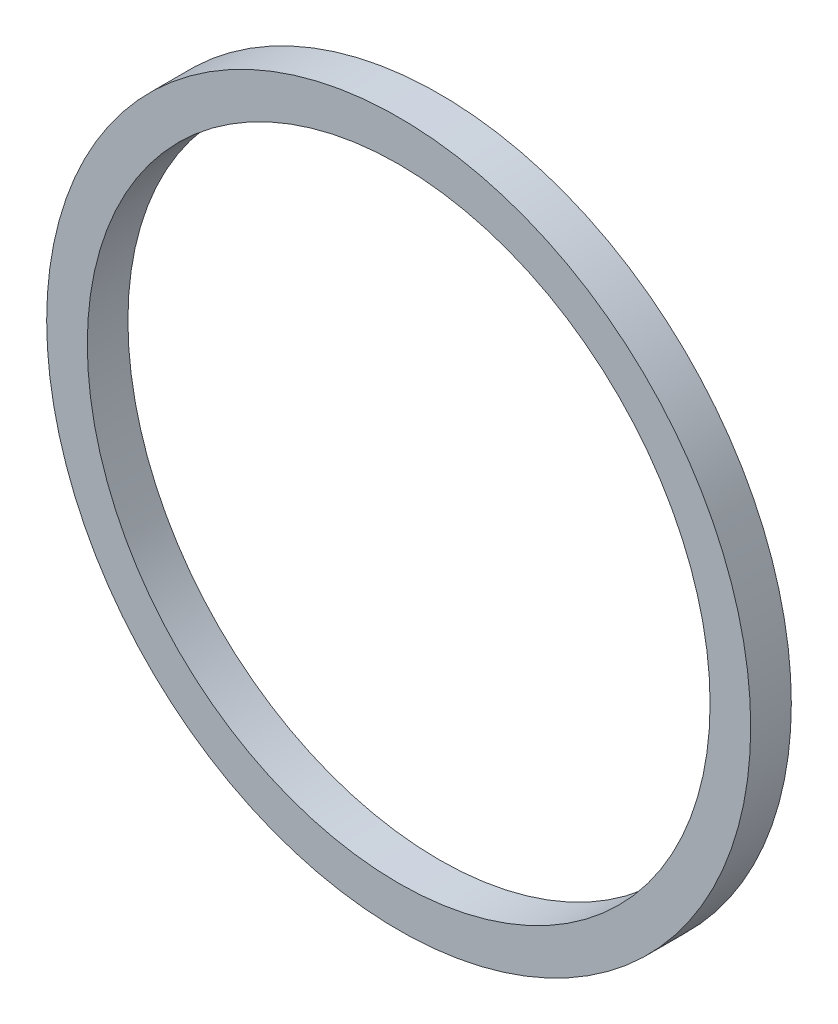
ISO-10303-21;
HEADER;
FILE_DESCRIPTION(('STEP AP214'),'2;1');
FILE_NAME('part.step','',(''),(''),'','','');
FILE_SCHEMA(('AUTOMOTIVE_DESIGN { 1 0 10303 214 1 1 1 1 }'));
ENDSEC;
DATA;
#1=APPLICATION_CONTEXT('core data for automotive mechanical design processes');
#2=APPLICATION_PROTOCOL_DEFINITION('international standard','automotive_design',2000,#1);
#3=PRODUCT_CONTEXT('',#1,'mechanical');
#4=PRODUCT('Part','Part','',(#3));
#5=PRODUCT_RELATED_PRODUCT_CATEGORY('part','',(#4));
#6=PRODUCT_DEFINITION_FORMATION('','',#4);
#7=PRODUCT_DEFINITION_CONTEXT('part definition',#1,'design');
#8=PRODUCT_DEFINITION('design','',#6,#7);
#9=PRODUCT_DEFINITION_SHAPE('','',#8);
#10=(LENGTH_UNIT() NAMED_UNIT(*) SI_UNIT(.MILLI.,.METRE.));
#11=(NAMED_UNIT(*) PLANE_ANGLE_UNIT() SI_UNIT($,.RADIAN.));
#12=(NAMED_UNIT(*) SI_UNIT($,.STERADIAN.) SOLID_ANGLE_UNIT());
#13=UNCERTAINTY_MEASURE_WITH_UNIT(LENGTH_MEASURE(1.E-05),#10,'distance_accuracy_value','');
#14=(GEOMETRIC_REPRESENTATION_CONTEXT(3) GLOBAL_UNCERTAINTY_ASSIGNED_CONTEXT((#13)) GLOBAL_UNIT_ASSIGNED_CONTEXT((#10,
#11,#12)) REPRESENTATION_CONTEXT('',''));
#15=CARTESIAN_POINT('',(0.,0.,0.));
#16=DIRECTION('',(0.,0.,1.));
#17=DIRECTION('',(1.,0.,0.));
#18=AXIS2_PLACEMENT_3D('',#15,#16,#17);
#19=CARTESIAN_POINT('',(0.,0.,1.5));
#20=DIRECTION('',(0.,0.,1.));
#21=DIRECTION('',(1.,0.,0.));
#22=AXIS2_PLACEMENT_3D('',#19,#20,#21);
#23=PLANE('',#22);
#24=CARTESIAN_POINT('',(0.,0.,1.5));
#25=DIRECTION('',(0.,0.,1.));
#26=DIRECTION('',(1.,0.,0.));
#27=AXIS2_PLACEMENT_3D('',#24,#25,#26);
#28=CIRCLE('',#27,13.);
#29=CARTESIAN_POINT('',(13.,0.,1.5));
#30=VERTEX_POINT('',#29);
#31=EDGE_CURVE('E10',#30,#30,#28,.T.);
#32=ORIENTED_EDGE('',*,*,#31,.T.);
#33=EDGE_LOOP('',(#32));
#34=FACE_BOUND('',#33,.T.);
#35=CARTESIAN_POINT('',(0.,0.,1.5));
#36=DIRECTION('',(0.,0.,1.));
#37=DIRECTION('',(1.,0.,0.));
#38=AXIS2_PLACEMENT_3D('',#35,#36,#37);
#39=CIRCLE('',#38,11.5);
#40=CARTESIAN_POINT('',(11.5,0.,1.5));
#41=VERTEX_POINT('',#40);
#42=EDGE_CURVE('E48',#41,#41,#39,.T.);
#43=ORIENTED_EDGE('',*,*,#42,.F.);
#44=EDGE_LOOP('',(#43));
#45=FACE_BOUND('',#44,.T.);
#46=ADVANCED_FACE('F37',(#34,#45),#23,.T.);
#47=CARTESIAN_POINT('',(0.,0.,0.));
#48=DIRECTION('',(0.,0.,1.));
#49=DIRECTION('',(1.,0.,0.));
#50=AXIS2_PLACEMENT_3D('',#47,#48,#49);
#51=PLANE('',#50);
#52=CARTESIAN_POINT('',(0.,0.,0.));
#53=DIRECTION('',(0.,0.,1.));
#54=DIRECTION('',(1.,0.,0.));
#55=AXIS2_PLACEMENT_3D('',#52,#53,#54);
#56=CIRCLE('',#55,13.);
#57=CARTESIAN_POINT('',(13.,0.,0.));
#58=VERTEX_POINT('',#57);
#59=EDGE_CURVE('E41',#58,#58,#56,.T.);
#60=ORIENTED_EDGE('',*,*,#59,.F.);
#61=EDGE_LOOP('',(#60));
#62=FACE_BOUND('',#61,.T.);
#63=CARTESIAN_POINT('',(0.,0.,0.));
#64=DIRECTION('',(0.,0.,1.));
#65=DIRECTION('',(1.,0.,0.));
#66=AXIS2_PLACEMENT_3D('',#63,#64,#65);
#67=CIRCLE('',#66,11.5);
#68=CARTESIAN_POINT('',(11.5,0.,0.));
#69=VERTEX_POINT('',#68);
#70=EDGE_CURVE('E50',#69,#69,#67,.T.);
#71=ORIENTED_EDGE('',*,*,#70,.T.);
#72=EDGE_LOOP('',(#71));
#73=FACE_BOUND('',#72,.T.);
#74=ADVANCED_FACE('F60',(#62,#73),#51,.F.);
#75=CARTESIAN_POINT('',(0.,0.,1.5));
#76=DIRECTION('',(0.,0.,-1.));
#77=DIRECTION('',(-1.,0.,0.));
#78=AXIS2_PLACEMENT_3D('',#75,#76,#77);
#79=CYLINDRICAL_SURFACE('',#78,13.);
#80=ORIENTED_EDGE('',*,*,#31,.F.);
#81=EDGE_LOOP('',(#80));
#82=FACE_BOUND('',#81,.T.);
#83=ORIENTED_EDGE('',*,*,#59,.T.);
#84=EDGE_LOOP('',(#83));
#85=FACE_BOUND('',#84,.T.);
#86=ADVANCED_FACE('F39',(#82,#85),#79,.T.);
#87=CARTESIAN_POINT('',(0.,0.,1.5));
#88=DIRECTION('',(0.,0.,-1.));
#89=DIRECTION('',(-1.,0.,0.));
#90=AXIS2_PLACEMENT_3D('',#87,#88,#89);
#91=CYLINDRICAL_SURFACE('',#90,11.5);
#92=ORIENTED_EDGE('',*,*,#42,.T.);
#93=EDGE_LOOP('',(#92));
#94=FACE_BOUND('',#93,.T.);
#95=ORIENTED_EDGE('',*,*,#70,.F.);
#96=EDGE_LOOP('',(#95));
#97=FACE_BOUND('',#96,.T.);
#98=ADVANCED_FACE('F56',(#94,#97),#91,.F.);
#99=CLOSED_SHELL('',(#46,#74,#86,#98));
#100=MANIFOLD_SOLID_BREP('B2',#99);
#101=ADVANCED_BREP_SHAPE_REPRESENTATION('',(#18,#100),#14);
#102=SHAPE_DEFINITION_REPRESENTATION(#9,#101);
ENDSEC;
END-ISO-10303-21;
